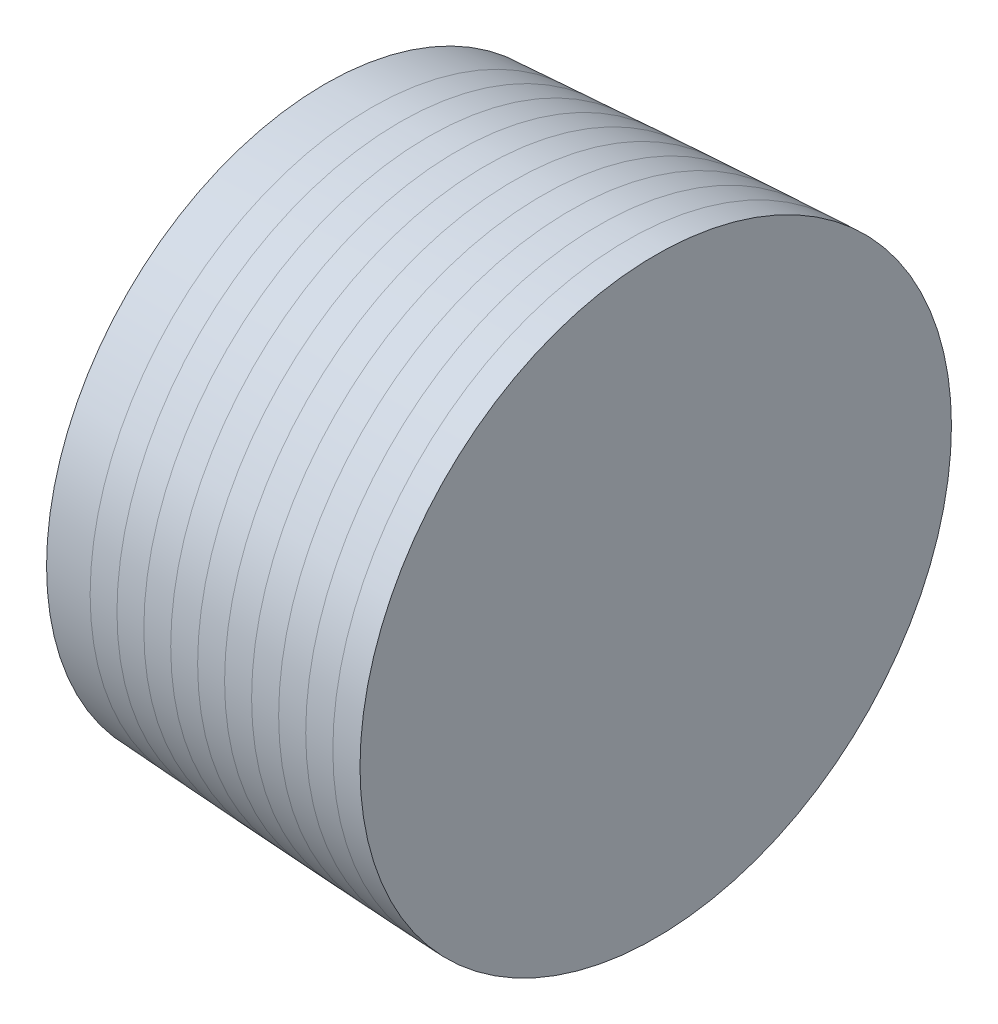
ISO-10303-21;
HEADER;
FILE_DESCRIPTION(('STEP AP214'),'2;1');
FILE_NAME('part.step','',(''),(''),'','','');
FILE_SCHEMA(('AUTOMOTIVE_DESIGN { 1 0 10303 214 1 1 1 1 }'));
ENDSEC;
DATA;
#1=APPLICATION_CONTEXT('core data for automotive mechanical design processes');
#2=APPLICATION_PROTOCOL_DEFINITION('international standard','automotive_design',2000,#1);
#3=PRODUCT_CONTEXT('',#1,'mechanical');
#4=PRODUCT('Part','Part','',(#3));
#5=PRODUCT_RELATED_PRODUCT_CATEGORY('part','',(#4));
#6=PRODUCT_DEFINITION_FORMATION('','',#4);
#7=PRODUCT_DEFINITION_CONTEXT('part definition',#1,'design');
#8=PRODUCT_DEFINITION('design','',#6,#7);
#9=PRODUCT_DEFINITION_SHAPE('','',#8);
#10=(LENGTH_UNIT() NAMED_UNIT(*) SI_UNIT(.MILLI.,.METRE.));
#11=(NAMED_UNIT(*) PLANE_ANGLE_UNIT() SI_UNIT($,.RADIAN.));
#12=(NAMED_UNIT(*) SI_UNIT($,.STERADIAN.) SOLID_ANGLE_UNIT());
#13=UNCERTAINTY_MEASURE_WITH_UNIT(LENGTH_MEASURE(1.E-05),#10,'distance_accuracy_value','');
#14=(GEOMETRIC_REPRESENTATION_CONTEXT(3) GLOBAL_UNCERTAINTY_ASSIGNED_CONTEXT((#13)) GLOBAL_UNIT_ASSIGNED_CONTEXT((#10,
#11,#12)) REPRESENTATION_CONTEXT('',''));
#15=CARTESIAN_POINT('',(0.,0.,0.));
#16=DIRECTION('',(0.,0.,1.));
#17=DIRECTION('',(1.,0.,0.));
#18=AXIS2_PLACEMENT_3D('',#15,#16,#17);
#19=CARTESIAN_POINT('',(504.19,0.,0.));
#20=DIRECTION('',(1.,0.,0.));
#21=DIRECTION('',(0.,0.,-1.));
#22=AXIS2_PLACEMENT_3D('',#19,#20,#21);
#23=PLANE('',#22);
#24=CARTESIAN_POINT('',(504.19,0.,0.));
#25=DIRECTION('',(-1.,0.,0.));
#26=DIRECTION('',(0.,0.,1.));
#27=AXIS2_PLACEMENT_3D('',#24,#25,#26);
#28=CIRCLE('',#27,53.9922702391482);
#29=CARTESIAN_POINT('',(504.19,0.,53.9922702391482));
#30=VERTEX_POINT('',#29);
#31=EDGE_CURVE('E11',#30,#30,#28,.F.);
#32=ORIENTED_EDGE('',*,*,#31,.F.);
#33=EDGE_LOOP('',(#32));
#34=FACE_BOUND('',#33,.T.);
#35=ADVANCED_FACE('F48',(#34),#23,.F.);
#36=CARTESIAN_POINT('',(509.651,0.,0.));
#37=DIRECTION('',(1.,0.,0.));
#38=DIRECTION('',(0.,0.,-1.));
#39=AXIS2_PLACEMENT_3D('',#36,#37,#38);
#40=PLANE('',#39);
#41=CARTESIAN_POINT('',(509.651,0.,0.));
#42=DIRECTION('',(-1.,0.,0.));
#43=DIRECTION('',(0.,0.,1.));
#44=AXIS2_PLACEMENT_3D('',#41,#42,#43);
#45=CIRCLE('',#44,54.303329995861);
#46=CARTESIAN_POINT('',(509.651,0.,54.303329995861));
#47=VERTEX_POINT('',#46);
#48=EDGE_CURVE('E58',#47,#47,#45,.F.);
#49=ORIENTED_EDGE('',*,*,#48,.T.);
#50=EDGE_LOOP('',(#49));
#51=FACE_BOUND('',#50,.T.);
#52=ADVANCED_FACE('F65',(#51),#40,.T.);
#53=CARTESIAN_POINT('',(635.,65.405,0.));
#54=CARTESIAN_POINT('',(632.980968041376,65.3999049079982,0.));
#55=CARTESIAN_POINT('',(628.943051518666,65.3607987649682,0.));
#56=CARTESIAN_POINT('',(620.867800743739,65.238425835158,0.));
#57=CARTESIAN_POINT('',(607.876612197197,64.9420444267635,0.));
#58=CARTESIAN_POINT('',(591.989866173885,64.4665825864284,0.));
#59=CARTESIAN_POINT('',(568.294487812533,63.5924578117391,0.));
#60=CARTESIAN_POINT('',(538.814064527861,62.2664605978091,0.));
#61=CARTESIAN_POINT('',(504.434100625351,60.4361863708921,0.));
#62=CARTESIAN_POINT('',(465.161890456531,58.0127528854532,0.));
#63=CARTESIAN_POINT('',(425.909385737502,55.2895252497301,0.));
#64=CARTESIAN_POINT('',(386.677550901074,52.2836135264071,0.));
#65=CARTESIAN_POINT('',(347.46776242828,49.0025673324941,0.));
#66=CARTESIAN_POINT('',(308.282068325667,45.4454012222465,0.));
#67=CARTESIAN_POINT('',(269.123174714222,41.6037605555624,0.));
#68=CARTESIAN_POINT('',(229.995170684784,37.4592339547084,0.));
#69=CARTESIAN_POINT('',(190.90356887878,32.9826992551564,0.));
#70=CARTESIAN_POINT('',(151.857530337521,28.1241973222402,0.));
#71=CARTESIAN_POINT('',(112.870807325211,22.8061369351955,0.));
#72=CARTESIAN_POINT('',(77.9573287846358,17.4873019784259,0.));
#73=CARTESIAN_POINT('',(49.691922506701,12.6022621047292,0.));
#74=CARTESIAN_POINT('',(31.2124598134355,8.89829644794129,0.));
#75=CARTESIAN_POINT('',(22.4234973059566,6.91999826072989,0.));
#76=CARTESIAN_POINT('',(19.3075240312599,6.17668852516933,0.));
#77=B_SPLINE_CURVE_WITH_KNOTS('',4,(#53,#54,#55,#56,#57,#58,#59,#60,#61,#62,#63,#64,#65,#66,#67,
#68,#69,#70,#71,#72,#73,#74,#75,#76),.UNSPECIFIED.,.F.,.F.,(5,1,1,1,1,1,1,1,1,1,1,1,1,1,1,1,1,1,
1,1,5),(0.,0.0126278600836156,0.0252557201672313,0.0505114403344626,0.0812725997628029,
0.112033759191143,0.173556078208551,0.235078396298971,0.296600715210933,0.358123034494872,
0.419645352372099,0.481167670690979,0.542689989321029,0.604212308113024,0.665734626856386,
0.727256945203041,0.788779262537685,0.850301578000527,0.911823895791277,0.948128969524394,
0.968164565063639),.UNSPECIFIED.);
#78=CARTESIAN_POINT('',(0.,0.,0.));
#79=DIRECTION('',(-1.,0.,0.));
#80=AXIS1_PLACEMENT('',#78,#79);
#81=SURFACE_OF_REVOLUTION('',#77,#80);
#82=OFFSET_SURFACE('',#81,-6.35,.F.);
#83=ORIENTED_EDGE('',*,*,#31,.T.);
#84=EDGE_LOOP('',(#83));
#85=FACE_BOUND('',#84,.T.);
#86=ORIENTED_EDGE('',*,*,#48,.F.);
#87=EDGE_LOOP('',(#86));
#88=FACE_BOUND('',#87,.T.);
#89=ADVANCED_FACE('F67',(#85,#88),#82,.T.);
#90=CLOSED_SHELL('',(#35,#52,#89));
#91=MANIFOLD_SOLID_BREP('B2',#90);
#92=CARTESIAN_POINT('',(515.112,0.,0.));
#93=DIRECTION('',(1.,0.,0.));
#94=DIRECTION('',(0.,0.,-1.));
#95=AXIS2_PLACEMENT_3D('',#92,#93,#94);
#96=PLANE('',#95);
#97=CARTESIAN_POINT('',(515.112,0.,0.));
#98=DIRECTION('',(-1.,0.,0.));
#99=DIRECTION('',(0.,0.,1.));
#100=AXIS2_PLACEMENT_3D('',#97,#98,#99);
#101=CIRCLE('',#100,54.6077792733118);
#102=CARTESIAN_POINT('',(515.112,0.,54.6077792733118));
#103=VERTEX_POINT('',#102);
#104=EDGE_CURVE('E47',#103,#103,#101,.F.);
#105=ORIENTED_EDGE('',*,*,#104,.F.);
#106=EDGE_LOOP('',(#105));
#107=FACE_BOUND('',#106,.T.);
#108=ADVANCED_FACE('F108',(#107),#96,.F.);
#109=CARTESIAN_POINT('',(520.573,0.,0.));
#110=DIRECTION('',(1.,0.,0.));
#111=DIRECTION('',(0.,0.,-1.));
#112=AXIS2_PLACEMENT_3D('',#109,#110,#111);
#113=PLANE('',#112);
#114=CARTESIAN_POINT('',(520.573,0.,0.));
#115=DIRECTION('',(-1.,0.,0.));
#116=DIRECTION('',(0.,0.,1.));
#117=AXIS2_PLACEMENT_3D('',#114,#115,#116);
#118=CIRCLE('',#117,54.9054868575674);
#119=CARTESIAN_POINT('',(520.573,0.,54.9054868575674));
#120=VERTEX_POINT('',#119);
#121=EDGE_CURVE('E118',#120,#120,#118,.F.);
#122=ORIENTED_EDGE('',*,*,#121,.T.);
#123=EDGE_LOOP('',(#122));
#124=FACE_BOUND('',#123,.T.);
#125=ADVANCED_FACE('F125',(#124),#113,.T.);
#126=CARTESIAN_POINT('',(635.,65.405,0.));
#127=CARTESIAN_POINT('',(632.980968041376,65.3999049079982,0.));
#128=CARTESIAN_POINT('',(628.943051518666,65.3607987649682,0.));
#129=CARTESIAN_POINT('',(620.867800743739,65.238425835158,0.));
#130=CARTESIAN_POINT('',(607.876612197197,64.9420444267635,0.));
#131=CARTESIAN_POINT('',(591.989866173885,64.4665825864284,0.));
#132=CARTESIAN_POINT('',(568.294487812533,63.5924578117391,0.));
#133=CARTESIAN_POINT('',(538.814064527861,62.2664605978091,0.));
#134=CARTESIAN_POINT('',(504.434100625351,60.4361863708921,0.));
#135=CARTESIAN_POINT('',(465.161890456531,58.0127528854532,0.));
#136=CARTESIAN_POINT('',(425.909385737502,55.2895252497301,0.));
#137=CARTESIAN_POINT('',(386.677550901074,52.2836135264071,0.));
#138=CARTESIAN_POINT('',(347.46776242828,49.0025673324941,0.));
#139=CARTESIAN_POINT('',(308.282068325667,45.4454012222465,0.));
#140=CARTESIAN_POINT('',(269.123174714222,41.6037605555624,0.));
#141=CARTESIAN_POINT('',(229.995170684784,37.4592339547084,0.));
#142=CARTESIAN_POINT('',(190.90356887878,32.9826992551564,0.));
#143=CARTESIAN_POINT('',(151.857530337521,28.1241973222402,0.));
#144=CARTESIAN_POINT('',(112.870807325211,22.8061369351955,0.));
#145=CARTESIAN_POINT('',(77.9573287846358,17.4873019784259,0.));
#146=CARTESIAN_POINT('',(49.691922506701,12.6022621047292,0.));
#147=CARTESIAN_POINT('',(31.2124598134355,8.89829644794129,0.));
#148=CARTESIAN_POINT('',(22.4234973059566,6.91999826072989,0.));
#149=CARTESIAN_POINT('',(19.3075240312599,6.17668852516933,0.));
#150=B_SPLINE_CURVE_WITH_KNOTS('',4,(#126,#127,#128,#129,#130,#131,#132,#133,#134,#135,#136,
#137,#138,#139,#140,#141,#142,#143,#144,#145,#146,#147,#148,#149),.UNSPECIFIED.,.F.,.F.,(5,1,1,
1,1,1,1,1,1,1,1,1,1,1,1,1,1,1,1,1,5),(0.,0.0126278600836156,0.0252557201672313,
0.0505114403344626,0.0812725997628029,0.112033759191143,0.173556078208551,0.235078396298971,
0.296600715210933,0.358123034494872,0.419645352372099,0.481167670690979,0.542689989321029,
0.604212308113024,0.665734626856386,0.727256945203041,0.788779262537685,0.850301578000527,
0.911823895791277,0.948128969524394,0.968164565063639),.UNSPECIFIED.);
#151=CARTESIAN_POINT('',(0.,0.,0.));
#152=DIRECTION('',(-1.,0.,0.));
#153=AXIS1_PLACEMENT('',#151,#152);
#154=SURFACE_OF_REVOLUTION('',#150,#153);
#155=OFFSET_SURFACE('',#154,-6.35,.F.);
#156=ORIENTED_EDGE('',*,*,#104,.T.);
#157=EDGE_LOOP('',(#156));
#158=FACE_BOUND('',#157,.T.);
#159=ORIENTED_EDGE('',*,*,#121,.F.);
#160=EDGE_LOOP('',(#159));
#161=FACE_BOUND('',#160,.T.);
#162=ADVANCED_FACE('F127',(#158,#161),#155,.T.);
#163=CLOSED_SHELL('',(#108,#125,#162));
#164=MANIFOLD_SOLID_BREP('B6',#163);
#165=CARTESIAN_POINT('',(531.495,0.,0.));
#166=DIRECTION('',(1.,0.,0.));
#167=DIRECTION('',(0.,0.,-1.));
#168=AXIS2_PLACEMENT_3D('',#165,#166,#167);
#169=PLANE('',#168);
#170=CARTESIAN_POINT('',(531.495,0.,0.));
#171=DIRECTION('',(-1.,0.,0.));
#172=DIRECTION('',(0.,0.,1.));
#173=AXIS2_PLACEMENT_3D('',#170,#171,#172);
#174=CIRCLE('',#173,55.4801039444911);
#175=CARTESIAN_POINT('',(531.495,0.,55.4801039444911));
#176=VERTEX_POINT('',#175);
#177=EDGE_CURVE('E107',#176,#176,#174,.F.);
#178=ORIENTED_EDGE('',*,*,#177,.F.);
#179=EDGE_LOOP('',(#178));
#180=FACE_BOUND('',#179,.T.);
#181=ADVANCED_FACE('F168',(#180),#169,.F.);
#182=CARTESIAN_POINT('',(536.956,0.,0.));
#183=DIRECTION('',(1.,0.,0.));
#184=DIRECTION('',(0.,0.,-1.));
#185=AXIS2_PLACEMENT_3D('',#182,#183,#184);
#186=PLANE('',#185);
#187=CARTESIAN_POINT('',(536.956,0.,0.));
#188=DIRECTION('',(-1.,0.,0.));
#189=DIRECTION('',(0.,0.,1.));
#190=AXIS2_PLACEMENT_3D('',#187,#188,#189);
#191=CIRCLE('',#190,55.7566922304204);
#192=CARTESIAN_POINT('',(536.956,0.,55.7566922304204));
#193=VERTEX_POINT('',#192);
#194=EDGE_CURVE('E178',#193,#193,#191,.F.);
#195=ORIENTED_EDGE('',*,*,#194,.T.);
#196=EDGE_LOOP('',(#195));
#197=FACE_BOUND('',#196,.T.);
#198=ADVANCED_FACE('F185',(#197),#186,.T.);
#199=CARTESIAN_POINT('',(635.,65.405,0.));
#200=CARTESIAN_POINT('',(632.980968041376,65.3999049079982,0.));
#201=CARTESIAN_POINT('',(628.943051518666,65.3607987649682,0.));
#202=CARTESIAN_POINT('',(620.867800743739,65.238425835158,0.));
#203=CARTESIAN_POINT('',(607.876612197197,64.9420444267635,0.));
#204=CARTESIAN_POINT('',(591.989866173885,64.4665825864284,0.));
#205=CARTESIAN_POINT('',(568.294487812533,63.5924578117391,0.));
#206=CARTESIAN_POINT('',(538.814064527861,62.2664605978091,0.));
#207=CARTESIAN_POINT('',(504.434100625351,60.4361863708921,0.));
#208=CARTESIAN_POINT('',(465.161890456531,58.0127528854532,0.));
#209=CARTESIAN_POINT('',(425.909385737502,55.2895252497301,0.));
#210=CARTESIAN_POINT('',(386.677550901074,52.2836135264071,0.));
#211=CARTESIAN_POINT('',(347.46776242828,49.0025673324941,0.));
#212=CARTESIAN_POINT('',(308.282068325667,45.4454012222465,0.));
#213=CARTESIAN_POINT('',(269.123174714222,41.6037605555624,0.));
#214=CARTESIAN_POINT('',(229.995170684784,37.4592339547084,0.));
#215=CARTESIAN_POINT('',(190.90356887878,32.9826992551564,0.));
#216=CARTESIAN_POINT('',(151.857530337521,28.1241973222402,0.));
#217=CARTESIAN_POINT('',(112.870807325211,22.8061369351955,0.));
#218=CARTESIAN_POINT('',(77.9573287846358,17.4873019784259,0.));
#219=CARTESIAN_POINT('',(49.691922506701,12.6022621047292,0.));
#220=CARTESIAN_POINT('',(31.2124598134355,8.89829644794129,0.));
#221=CARTESIAN_POINT('',(22.4234973059566,6.91999826072989,0.));
#222=CARTESIAN_POINT('',(19.3075240312599,6.17668852516933,0.));
#223=B_SPLINE_CURVE_WITH_KNOTS('',4,(#199,#200,#201,#202,#203,#204,#205,#206,#207,#208,#209,
#210,#211,#212,#213,#214,#215,#216,#217,#218,#219,#220,#221,#222),.UNSPECIFIED.,.F.,.F.,(5,1,1,
1,1,1,1,1,1,1,1,1,1,1,1,1,1,1,1,1,5),(0.,0.0126278600836156,0.0252557201672313,
0.0505114403344626,0.0812725997628029,0.112033759191143,0.173556078208551,0.235078396298971,
0.296600715210933,0.358123034494872,0.419645352372099,0.481167670690979,0.542689989321029,
0.604212308113024,0.665734626856386,0.727256945203041,0.788779262537685,0.850301578000527,
0.911823895791277,0.948128969524394,0.968164565063639),.UNSPECIFIED.);
#224=CARTESIAN_POINT('',(0.,0.,0.));
#225=DIRECTION('',(-1.,0.,0.));
#226=AXIS1_PLACEMENT('',#224,#225);
#227=SURFACE_OF_REVOLUTION('',#223,#226);
#228=OFFSET_SURFACE('',#227,-6.35,.F.);
#229=ORIENTED_EDGE('',*,*,#177,.T.);
#230=EDGE_LOOP('',(#229));
#231=FACE_BOUND('',#230,.T.);
#232=ORIENTED_EDGE('',*,*,#194,.F.);
#233=EDGE_LOOP('',(#232));
#234=FACE_BOUND('',#233,.T.);
#235=ADVANCED_FACE('F187',(#231,#234),#228,.T.);
#236=CLOSED_SHELL('',(#181,#198,#235));
#237=MANIFOLD_SOLID_BREP('B42',#236);
#238=CARTESIAN_POINT('',(536.956,0.,0.));
#239=DIRECTION('',(1.,0.,0.));
#240=DIRECTION('',(0.,0.,-1.));
#241=AXIS2_PLACEMENT_3D('',#238,#239,#240);
#242=PLANE('',#241);
#243=CARTESIAN_POINT('',(536.956,0.,0.));
#244=DIRECTION('',(-1.,0.,0.));
#245=DIRECTION('',(0.,0.,1.));
#246=AXIS2_PLACEMENT_3D('',#243,#244,#245);
#247=CIRCLE('',#246,55.7566922304204);
#248=CARTESIAN_POINT('',(536.956,0.,55.7566922304204));
#249=VERTEX_POINT('',#248);
#250=EDGE_CURVE('E167',#249,#249,#247,.F.);
#251=ORIENTED_EDGE('',*,*,#250,.F.);
#252=EDGE_LOOP('',(#251));
#253=FACE_BOUND('',#252,.T.);
#254=ADVANCED_FACE('F228',(#253),#242,.F.);
#255=CARTESIAN_POINT('',(542.417,0.,0.));
#256=DIRECTION('',(1.,0.,0.));
#257=DIRECTION('',(0.,0.,-1.));
#258=AXIS2_PLACEMENT_3D('',#255,#256,#257);
#259=PLANE('',#258);
#260=CARTESIAN_POINT('',(542.417,0.,0.));
#261=DIRECTION('',(-1.,0.,0.));
#262=DIRECTION('',(0.,0.,1.));
#263=AXIS2_PLACEMENT_3D('',#260,#261,#262);
#264=CIRCLE('',#263,56.025884843362);
#265=CARTESIAN_POINT('',(542.417,0.,56.025884843362));
#266=VERTEX_POINT('',#265);
#267=EDGE_CURVE('E238',#266,#266,#264,.F.);
#268=ORIENTED_EDGE('',*,*,#267,.T.);
#269=EDGE_LOOP('',(#268));
#270=FACE_BOUND('',#269,.T.);
#271=ADVANCED_FACE('F245',(#270),#259,.T.);
#272=CARTESIAN_POINT('',(635.,65.405,0.));
#273=CARTESIAN_POINT('',(632.980968041376,65.3999049079982,0.));
#274=CARTESIAN_POINT('',(628.943051518666,65.3607987649682,0.));
#275=CARTESIAN_POINT('',(620.867800743739,65.238425835158,0.));
#276=CARTESIAN_POINT('',(607.876612197197,64.9420444267635,0.));
#277=CARTESIAN_POINT('',(591.989866173885,64.4665825864284,0.));
#278=CARTESIAN_POINT('',(568.294487812533,63.5924578117391,0.));
#279=CARTESIAN_POINT('',(538.814064527861,62.2664605978091,0.));
#280=CARTESIAN_POINT('',(504.434100625351,60.4361863708921,0.));
#281=CARTESIAN_POINT('',(465.161890456531,58.0127528854532,0.));
#282=CARTESIAN_POINT('',(425.909385737502,55.2895252497301,0.));
#283=CARTESIAN_POINT('',(386.677550901074,52.2836135264071,0.));
#284=CARTESIAN_POINT('',(347.46776242828,49.0025673324941,0.));
#285=CARTESIAN_POINT('',(308.282068325667,45.4454012222465,0.));
#286=CARTESIAN_POINT('',(269.123174714222,41.6037605555624,0.));
#287=CARTESIAN_POINT('',(229.995170684784,37.4592339547084,0.));
#288=CARTESIAN_POINT('',(190.90356887878,32.9826992551564,0.));
#289=CARTESIAN_POINT('',(151.857530337521,28.1241973222402,0.));
#290=CARTESIAN_POINT('',(112.870807325211,22.8061369351955,0.));
#291=CARTESIAN_POINT('',(77.9573287846358,17.4873019784259,0.));
#292=CARTESIAN_POINT('',(49.691922506701,12.6022621047292,0.));
#293=CARTESIAN_POINT('',(31.2124598134355,8.89829644794129,0.));
#294=CARTESIAN_POINT('',(22.4234973059566,6.91999826072989,0.));
#295=CARTESIAN_POINT('',(19.3075240312599,6.17668852516933,0.));
#296=B_SPLINE_CURVE_WITH_KNOTS('',4,(#272,#273,#274,#275,#276,#277,#278,#279,#280,#281,#282,
#283,#284,#285,#286,#287,#288,#289,#290,#291,#292,#293,#294,#295),.UNSPECIFIED.,.F.,.F.,(5,1,1,
1,1,1,1,1,1,1,1,1,1,1,1,1,1,1,1,1,5),(0.,0.0126278600836156,0.0252557201672313,
0.0505114403344626,0.0812725997628029,0.112033759191143,0.173556078208551,0.235078396298971,
0.296600715210933,0.358123034494872,0.419645352372099,0.481167670690979,0.542689989321029,
0.604212308113024,0.665734626856386,0.727256945203041,0.788779262537685,0.850301578000527,
0.911823895791277,0.948128969524394,0.968164565063639),.UNSPECIFIED.);
#297=CARTESIAN_POINT('',(0.,0.,0.));
#298=DIRECTION('',(-1.,0.,0.));
#299=AXIS1_PLACEMENT('',#297,#298);
#300=SURFACE_OF_REVOLUTION('',#296,#299);
#301=OFFSET_SURFACE('',#300,-6.35,.F.);
#302=ORIENTED_EDGE('',*,*,#250,.T.);
#303=EDGE_LOOP('',(#302));
#304=FACE_BOUND('',#303,.T.);
#305=ORIENTED_EDGE('',*,*,#267,.F.);
#306=EDGE_LOOP('',(#305));
#307=FACE_BOUND('',#306,.T.);
#308=ADVANCED_FACE('F247',(#304,#307),#301,.T.);
#309=CLOSED_SHELL('',(#254,#271,#308));
#310=MANIFOLD_SOLID_BREP('B102',#309);
#311=CARTESIAN_POINT('',(547.878,0.,0.));
#312=DIRECTION('',(1.,0.,0.));
#313=DIRECTION('',(0.,0.,-1.));
#314=AXIS2_PLACEMENT_3D('',#311,#312,#313);
#315=PLANE('',#314);
#316=CARTESIAN_POINT('',(547.878,0.,0.));
#317=DIRECTION('',(-1.,0.,0.));
#318=DIRECTION('',(0.,0.,1.));
#319=AXIS2_PLACEMENT_3D('',#316,#317,#318);
#320=CIRCLE('',#319,56.287467029387);
#321=CARTESIAN_POINT('',(547.878,0.,56.287467029387));
#322=VERTEX_POINT('',#321);
#323=EDGE_CURVE('E292',#322,#322,#320,.F.);
#324=ORIENTED_EDGE('',*,*,#323,.F.);
#325=EDGE_LOOP('',(#324));
#326=FACE_BOUND('',#325,.T.);
#327=ADVANCED_FACE('F288',(#326),#315,.F.);
#328=CARTESIAN_POINT('',(553.339,0.,0.));
#329=DIRECTION('',(1.,0.,0.));
#330=DIRECTION('',(0.,0.,-1.));
#331=AXIS2_PLACEMENT_3D('',#328,#329,#330);
#332=PLANE('',#331);
#333=CARTESIAN_POINT('',(553.339,0.,0.));
#334=DIRECTION('',(-1.,0.,0.));
#335=DIRECTION('',(0.,0.,1.));
#336=AXIS2_PLACEMENT_3D('',#333,#334,#335);
#337=CIRCLE('',#336,56.5412015126397);
#338=CARTESIAN_POINT('',(553.339,0.,56.5412015126397));
#339=VERTEX_POINT('',#338);
#340=EDGE_CURVE('E227',#339,#339,#337,.F.);
#341=ORIENTED_EDGE('',*,*,#340,.T.);
#342=EDGE_LOOP('',(#341));
#343=FACE_BOUND('',#342,.T.);
#344=ADVANCED_FACE('F290',(#343),#332,.T.);
#345=CARTESIAN_POINT('',(635.,65.405,0.));
#346=CARTESIAN_POINT('',(632.980968041376,65.3999049079982,0.));
#347=CARTESIAN_POINT('',(628.943051518666,65.3607987649682,0.));
#348=CARTESIAN_POINT('',(620.867800743739,65.238425835158,0.));
#349=CARTESIAN_POINT('',(607.876612197197,64.9420444267635,0.));
#350=CARTESIAN_POINT('',(591.989866173885,64.4665825864284,0.));
#351=CARTESIAN_POINT('',(568.294487812533,63.5924578117391,0.));
#352=CARTESIAN_POINT('',(538.814064527861,62.2664605978091,0.));
#353=CARTESIAN_POINT('',(504.434100625351,60.4361863708921,0.));
#354=CARTESIAN_POINT('',(465.161890456531,58.0127528854532,0.));
#355=CARTESIAN_POINT('',(425.909385737502,55.2895252497301,0.));
#356=CARTESIAN_POINT('',(386.677550901074,52.2836135264071,0.));
#357=CARTESIAN_POINT('',(347.46776242828,49.0025673324941,0.));
#358=CARTESIAN_POINT('',(308.282068325667,45.4454012222465,0.));
#359=CARTESIAN_POINT('',(269.123174714222,41.6037605555624,0.));
#360=CARTESIAN_POINT('',(229.995170684784,37.4592339547084,0.));
#361=CARTESIAN_POINT('',(190.90356887878,32.9826992551564,0.));
#362=CARTESIAN_POINT('',(151.857530337521,28.1241973222402,0.));
#363=CARTESIAN_POINT('',(112.870807325211,22.8061369351955,0.));
#364=CARTESIAN_POINT('',(77.9573287846358,17.4873019784259,0.));
#365=CARTESIAN_POINT('',(49.691922506701,12.6022621047292,0.));
#366=CARTESIAN_POINT('',(31.2124598134355,8.89829644794129,0.));
#367=CARTESIAN_POINT('',(22.4234973059566,6.91999826072989,0.));
#368=CARTESIAN_POINT('',(19.3075240312599,6.17668852516933,0.));
#369=B_SPLINE_CURVE_WITH_KNOTS('',4,(#345,#346,#347,#348,#349,#350,#351,#352,#353,#354,#355,
#356,#357,#358,#359,#360,#361,#362,#363,#364,#365,#366,#367,#368),.UNSPECIFIED.,.F.,.F.,(5,1,1,
1,1,1,1,1,1,1,1,1,1,1,1,1,1,1,1,1,5),(0.,0.0126278600836156,0.0252557201672313,
0.0505114403344626,0.0812725997628029,0.112033759191143,0.173556078208551,0.235078396298971,
0.296600715210933,0.358123034494872,0.419645352372099,0.481167670690979,0.542689989321029,
0.604212308113024,0.665734626856386,0.727256945203041,0.788779262537685,0.850301578000527,
0.911823895791277,0.948128969524394,0.968164565063639),.UNSPECIFIED.);
#370=CARTESIAN_POINT('',(0.,0.,0.));
#371=DIRECTION('',(-1.,0.,0.));
#372=AXIS1_PLACEMENT('',#370,#371);
#373=SURFACE_OF_REVOLUTION('',#369,#372);
#374=OFFSET_SURFACE('',#373,-6.35,.F.);
#375=ORIENTED_EDGE('',*,*,#323,.T.);
#376=EDGE_LOOP('',(#375));
#377=FACE_BOUND('',#376,.T.);
#378=ORIENTED_EDGE('',*,*,#340,.F.);
#379=EDGE_LOOP('',(#378));
#380=FACE_BOUND('',#379,.T.);
#381=ADVANCED_FACE('F309',(#377,#380),#374,.T.);
#382=CLOSED_SHELL('',(#327,#344,#381));
#383=MANIFOLD_SOLID_BREP('B162',#382);
#384=CARTESIAN_POINT('',(553.339,0.,0.));
#385=DIRECTION('',(1.,0.,0.));
#386=DIRECTION('',(0.,0.,-1.));
#387=AXIS2_PLACEMENT_3D('',#384,#385,#386);
#388=PLANE('',#387);
#389=CARTESIAN_POINT('',(553.339,0.,0.));
#390=DIRECTION('',(-1.,0.,0.));
#391=DIRECTION('',(0.,0.,1.));
#392=AXIS2_PLACEMENT_3D('',#389,#390,#391);
#393=CIRCLE('',#392,56.5412015126397);
#394=CARTESIAN_POINT('',(553.339,0.,56.5412015126397));
#395=VERTEX_POINT('',#394);
#396=EDGE_CURVE('E358',#395,#395,#393,.F.);
#397=ORIENTED_EDGE('',*,*,#396,.F.);
#398=EDGE_LOOP('',(#397));
#399=FACE_BOUND('',#398,.T.);
#400=ADVANCED_FACE('F348',(#399),#388,.F.);
#401=CARTESIAN_POINT('',(558.8,0.,0.));
#402=DIRECTION('',(1.,0.,0.));
#403=DIRECTION('',(0.,0.,-1.));
#404=AXIS2_PLACEMENT_3D('',#401,#402,#403);
#405=PLANE('',#404);
#406=CARTESIAN_POINT('',(558.8,0.,0.));
#407=DIRECTION('',(-1.,0.,0.));
#408=DIRECTION('',(0.,0.,1.));
#409=AXIS2_PLACEMENT_3D('',#406,#407,#408);
#410=CIRCLE('',#409,56.7868285004782);
#411=CARTESIAN_POINT('',(558.8,0.,56.7868285004782));
#412=VERTEX_POINT('',#411);
#413=EDGE_CURVE('E287',#412,#412,#410,.T.);
#414=ORIENTED_EDGE('',*,*,#413,.F.);
#415=EDGE_LOOP('',(#414));
#416=FACE_BOUND('',#415,.T.);
#417=ADVANCED_FACE('F368',(#416),#405,.T.);
#418=CARTESIAN_POINT('',(635.,65.405,0.));
#419=CARTESIAN_POINT('',(632.980968041376,65.3999049079982,0.));
#420=CARTESIAN_POINT('',(628.943051518666,65.3607987649682,0.));
#421=CARTESIAN_POINT('',(620.867800743739,65.238425835158,0.));
#422=CARTESIAN_POINT('',(607.876612197197,64.9420444267635,0.));
#423=CARTESIAN_POINT('',(591.989866173885,64.4665825864284,0.));
#424=CARTESIAN_POINT('',(568.294487812533,63.5924578117391,0.));
#425=CARTESIAN_POINT('',(538.814064527861,62.2664605978091,0.));
#426=CARTESIAN_POINT('',(504.434100625351,60.4361863708921,0.));
#427=CARTESIAN_POINT('',(465.161890456531,58.0127528854532,0.));
#428=CARTESIAN_POINT('',(425.909385737502,55.2895252497301,0.));
#429=CARTESIAN_POINT('',(386.677550901074,52.2836135264071,0.));
#430=CARTESIAN_POINT('',(347.46776242828,49.0025673324941,0.));
#431=CARTESIAN_POINT('',(308.282068325667,45.4454012222465,0.));
#432=CARTESIAN_POINT('',(269.123174714222,41.6037605555624,0.));
#433=CARTESIAN_POINT('',(229.995170684784,37.4592339547084,0.));
#434=CARTESIAN_POINT('',(190.90356887878,32.9826992551564,0.));
#435=CARTESIAN_POINT('',(151.857530337521,28.1241973222402,0.));
#436=CARTESIAN_POINT('',(112.870807325211,22.8061369351955,0.));
#437=CARTESIAN_POINT('',(77.9573287846358,17.4873019784259,0.));
#438=CARTESIAN_POINT('',(49.691922506701,12.6022621047292,0.));
#439=CARTESIAN_POINT('',(31.2124598134355,8.89829644794129,0.));
#440=CARTESIAN_POINT('',(22.4234973059566,6.91999826072989,0.));
#441=CARTESIAN_POINT('',(19.3075240312599,6.17668852516933,0.));
#442=B_SPLINE_CURVE_WITH_KNOTS('',4,(#418,#419,#420,#421,#422,#423,#424,#425,#426,#427,#428,
#429,#430,#431,#432,#433,#434,#435,#436,#437,#438,#439,#440,#441),.UNSPECIFIED.,.F.,.F.,(5,1,1,
1,1,1,1,1,1,1,1,1,1,1,1,1,1,1,1,1,5),(0.,0.0126278600836156,0.0252557201672313,
0.0505114403344626,0.0812725997628029,0.112033759191143,0.173556078208551,0.235078396298971,
0.296600715210933,0.358123034494872,0.419645352372099,0.481167670690979,0.542689989321029,
0.604212308113024,0.665734626856386,0.727256945203041,0.788779262537685,0.850301578000527,
0.911823895791277,0.948128969524394,0.968164565063639),.UNSPECIFIED.);
#443=CARTESIAN_POINT('',(0.,0.,0.));
#444=DIRECTION('',(-1.,0.,0.));
#445=AXIS1_PLACEMENT('',#443,#444);
#446=SURFACE_OF_REVOLUTION('',#442,#445);
#447=OFFSET_SURFACE('',#446,-6.35,.F.);
#448=ORIENTED_EDGE('',*,*,#396,.T.);
#449=EDGE_LOOP('',(#448));
#450=FACE_BOUND('',#449,.T.);
#451=ORIENTED_EDGE('',*,*,#413,.T.);
#452=EDGE_LOOP('',(#451));
#453=FACE_BOUND('',#452,.T.);
#454=ADVANCED_FACE('F365',(#450,#453),#447,.T.);
#455=CLOSED_SHELL('',(#400,#417,#454));
#456=MANIFOLD_SOLID_BREP('B222',#455);
#457=CARTESIAN_POINT('',(509.651,0.,0.));
#458=DIRECTION('',(1.,0.,0.));
#459=DIRECTION('',(0.,0.,-1.));
#460=AXIS2_PLACEMENT_3D('',#457,#458,#459);
#461=PLANE('',#460);
#462=CARTESIAN_POINT('',(509.651,0.,0.));
#463=DIRECTION('',(-1.,0.,0.));
#464=DIRECTION('',(0.,0.,1.));
#465=AXIS2_PLACEMENT_3D('',#462,#463,#464);
#466=CIRCLE('',#465,54.303329995861);
#467=CARTESIAN_POINT('',(509.651,0.,54.303329995861));
#468=VERTEX_POINT('',#467);
#469=EDGE_CURVE('E347',#468,#468,#466,.F.);
#470=ORIENTED_EDGE('',*,*,#469,.F.);
#471=EDGE_LOOP('',(#470));
#472=FACE_BOUND('',#471,.T.);
#473=ADVANCED_FACE('F410',(#472),#461,.F.);
#474=CARTESIAN_POINT('',(515.112,0.,0.));
#475=DIRECTION('',(1.,0.,0.));
#476=DIRECTION('',(0.,0.,-1.));
#477=AXIS2_PLACEMENT_3D('',#474,#475,#476);
#478=PLANE('',#477);
#479=CARTESIAN_POINT('',(515.112,0.,0.));
#480=DIRECTION('',(-1.,0.,0.));
#481=DIRECTION('',(0.,0.,1.));
#482=AXIS2_PLACEMENT_3D('',#479,#480,#481);
#483=CIRCLE('',#482,54.6077792733118);
#484=CARTESIAN_POINT('',(515.112,0.,54.6077792733118));
#485=VERTEX_POINT('',#484);
#486=EDGE_CURVE('E420',#485,#485,#483,.F.);
#487=ORIENTED_EDGE('',*,*,#486,.T.);
#488=EDGE_LOOP('',(#487));
#489=FACE_BOUND('',#488,.T.);
#490=ADVANCED_FACE('F427',(#489),#478,.T.);
#491=CARTESIAN_POINT('',(635.,65.405,0.));
#492=CARTESIAN_POINT('',(632.980968041376,65.3999049079982,0.));
#493=CARTESIAN_POINT('',(628.943051518666,65.3607987649682,0.));
#494=CARTESIAN_POINT('',(620.867800743739,65.238425835158,0.));
#495=CARTESIAN_POINT('',(607.876612197197,64.9420444267635,0.));
#496=CARTESIAN_POINT('',(591.989866173885,64.4665825864284,0.));
#497=CARTESIAN_POINT('',(568.294487812533,63.5924578117391,0.));
#498=CARTESIAN_POINT('',(538.814064527861,62.2664605978091,0.));
#499=CARTESIAN_POINT('',(504.434100625351,60.4361863708921,0.));
#500=CARTESIAN_POINT('',(465.161890456531,58.0127528854532,0.));
#501=CARTESIAN_POINT('',(425.909385737502,55.2895252497301,0.));
#502=CARTESIAN_POINT('',(386.677550901074,52.2836135264071,0.));
#503=CARTESIAN_POINT('',(347.46776242828,49.0025673324941,0.));
#504=CARTESIAN_POINT('',(308.282068325667,45.4454012222465,0.));
#505=CARTESIAN_POINT('',(269.123174714222,41.6037605555624,0.));
#506=CARTESIAN_POINT('',(229.995170684784,37.4592339547084,0.));
#507=CARTESIAN_POINT('',(190.90356887878,32.9826992551564,0.));
#508=CARTESIAN_POINT('',(151.857530337521,28.1241973222402,0.));
#509=CARTESIAN_POINT('',(112.870807325211,22.8061369351955,0.));
#510=CARTESIAN_POINT('',(77.9573287846358,17.4873019784259,0.));
#511=CARTESIAN_POINT('',(49.691922506701,12.6022621047292,0.));
#512=CARTESIAN_POINT('',(31.2124598134355,8.89829644794129,0.));
#513=CARTESIAN_POINT('',(22.4234973059566,6.91999826072989,0.));
#514=CARTESIAN_POINT('',(19.3075240312599,6.17668852516933,0.));
#515=B_SPLINE_CURVE_WITH_KNOTS('',4,(#491,#492,#493,#494,#495,#496,#497,#498,#499,#500,#501,
#502,#503,#504,#505,#506,#507,#508,#509,#510,#511,#512,#513,#514),.UNSPECIFIED.,.F.,.F.,(5,1,1,
1,1,1,1,1,1,1,1,1,1,1,1,1,1,1,1,1,5),(0.,0.0126278600836156,0.0252557201672313,
0.0505114403344626,0.0812725997628029,0.112033759191143,0.173556078208551,0.235078396298971,
0.296600715210933,0.358123034494872,0.419645352372099,0.481167670690979,0.542689989321029,
0.604212308113024,0.665734626856386,0.727256945203041,0.788779262537685,0.850301578000527,
0.911823895791277,0.948128969524394,0.968164565063639),.UNSPECIFIED.);
#516=CARTESIAN_POINT('',(0.,0.,0.));
#517=DIRECTION('',(-1.,0.,0.));
#518=AXIS1_PLACEMENT('',#516,#517);
#519=SURFACE_OF_REVOLUTION('',#515,#518);
#520=OFFSET_SURFACE('',#519,-6.35,.F.);
#521=ORIENTED_EDGE('',*,*,#469,.T.);
#522=EDGE_LOOP('',(#521));
#523=FACE_BOUND('',#522,.T.);
#524=ORIENTED_EDGE('',*,*,#486,.F.);
#525=EDGE_LOOP('',(#524));
#526=FACE_BOUND('',#525,.T.);
#527=ADVANCED_FACE('F429',(#523,#526),#520,.T.);
#528=CLOSED_SHELL('',(#473,#490,#527));
#529=MANIFOLD_SOLID_BREP('B282',#528);
#530=CARTESIAN_POINT('',(520.573,0.,0.));
#531=DIRECTION('',(1.,0.,0.));
#532=DIRECTION('',(0.,0.,-1.));
#533=AXIS2_PLACEMENT_3D('',#530,#531,#532);
#534=PLANE('',#533);
#535=CARTESIAN_POINT('',(520.573,0.,0.));
#536=DIRECTION('',(-1.,0.,0.));
#537=DIRECTION('',(0.,0.,1.));
#538=AXIS2_PLACEMENT_3D('',#535,#536,#537);
#539=CIRCLE('',#538,54.9054868575674);
#540=CARTESIAN_POINT('',(520.573,0.,54.9054868575674));
#541=VERTEX_POINT('',#540);
#542=EDGE_CURVE('E409',#541,#541,#539,.F.);
#543=ORIENTED_EDGE('',*,*,#542,.F.);
#544=EDGE_LOOP('',(#543));
#545=FACE_BOUND('',#544,.T.);
#546=ADVANCED_FACE('F470',(#545),#534,.F.);
#547=CARTESIAN_POINT('',(526.034,0.,0.));
#548=DIRECTION('',(1.,0.,0.));
#549=DIRECTION('',(0.,0.,-1.));
#550=AXIS2_PLACEMENT_3D('',#547,#548,#549);
#551=PLANE('',#550);
#552=CARTESIAN_POINT('',(526.034,0.,0.));
#553=DIRECTION('',(-1.,0.,0.));
#554=DIRECTION('',(0.,0.,1.));
#555=AXIS2_PLACEMENT_3D('',#552,#553,#554);
#556=CIRCLE('',#555,55.1963122114712);
#557=CARTESIAN_POINT('',(526.034,0.,55.1963122114712));
#558=VERTEX_POINT('',#557);
#559=EDGE_CURVE('E480',#558,#558,#556,.F.);
#560=ORIENTED_EDGE('',*,*,#559,.T.);
#561=EDGE_LOOP('',(#560));
#562=FACE_BOUND('',#561,.T.);
#563=ADVANCED_FACE('F487',(#562),#551,.T.);
#564=CARTESIAN_POINT('',(635.,65.405,0.));
#565=CARTESIAN_POINT('',(632.980968041376,65.3999049079982,0.));
#566=CARTESIAN_POINT('',(628.943051518666,65.3607987649682,0.));
#567=CARTESIAN_POINT('',(620.867800743739,65.238425835158,0.));
#568=CARTESIAN_POINT('',(607.876612197197,64.9420444267635,0.));
#569=CARTESIAN_POINT('',(591.989866173885,64.4665825864284,0.));
#570=CARTESIAN_POINT('',(568.294487812533,63.5924578117391,0.));
#571=CARTESIAN_POINT('',(538.814064527861,62.2664605978091,0.));
#572=CARTESIAN_POINT('',(504.434100625351,60.4361863708921,0.));
#573=CARTESIAN_POINT('',(465.161890456531,58.0127528854532,0.));
#574=CARTESIAN_POINT('',(425.909385737502,55.2895252497301,0.));
#575=CARTESIAN_POINT('',(386.677550901074,52.2836135264071,0.));
#576=CARTESIAN_POINT('',(347.46776242828,49.0025673324941,0.));
#577=CARTESIAN_POINT('',(308.282068325667,45.4454012222465,0.));
#578=CARTESIAN_POINT('',(269.123174714222,41.6037605555624,0.));
#579=CARTESIAN_POINT('',(229.995170684784,37.4592339547084,0.));
#580=CARTESIAN_POINT('',(190.90356887878,32.9826992551564,0.));
#581=CARTESIAN_POINT('',(151.857530337521,28.1241973222402,0.));
#582=CARTESIAN_POINT('',(112.870807325211,22.8061369351955,0.));
#583=CARTESIAN_POINT('',(77.9573287846358,17.4873019784259,0.));
#584=CARTESIAN_POINT('',(49.691922506701,12.6022621047292,0.));
#585=CARTESIAN_POINT('',(31.2124598134355,8.89829644794129,0.));
#586=CARTESIAN_POINT('',(22.4234973059566,6.91999826072989,0.));
#587=CARTESIAN_POINT('',(19.3075240312599,6.17668852516933,0.));
#588=B_SPLINE_CURVE_WITH_KNOTS('',4,(#564,#565,#566,#567,#568,#569,#570,#571,#572,#573,#574,
#575,#576,#577,#578,#579,#580,#581,#582,#583,#584,#585,#586,#587),.UNSPECIFIED.,.F.,.F.,(5,1,1,
1,1,1,1,1,1,1,1,1,1,1,1,1,1,1,1,1,5),(0.,0.0126278600836156,0.0252557201672313,
0.0505114403344626,0.0812725997628029,0.112033759191143,0.173556078208551,0.235078396298971,
0.296600715210933,0.358123034494872,0.419645352372099,0.481167670690979,0.542689989321029,
0.604212308113024,0.665734626856386,0.727256945203041,0.788779262537685,0.850301578000527,
0.911823895791277,0.948128969524394,0.968164565063639),.UNSPECIFIED.);
#589=CARTESIAN_POINT('',(0.,0.,0.));
#590=DIRECTION('',(-1.,0.,0.));
#591=AXIS1_PLACEMENT('',#589,#590);
#592=SURFACE_OF_REVOLUTION('',#588,#591);
#593=OFFSET_SURFACE('',#592,-6.35,.F.);
#594=ORIENTED_EDGE('',*,*,#542,.T.);
#595=EDGE_LOOP('',(#594));
#596=FACE_BOUND('',#595,.T.);
#597=ORIENTED_EDGE('',*,*,#559,.F.);
#598=EDGE_LOOP('',(#597));
#599=FACE_BOUND('',#598,.T.);
#600=ADVANCED_FACE('F489',(#596,#599),#593,.T.);
#601=CLOSED_SHELL('',(#546,#563,#600));
#602=MANIFOLD_SOLID_BREP('B342',#601);
#603=CARTESIAN_POINT('',(526.034,0.,0.));
#604=DIRECTION('',(1.,0.,0.));
#605=DIRECTION('',(0.,0.,-1.));
#606=AXIS2_PLACEMENT_3D('',#603,#604,#605);
#607=PLANE('',#606);
#608=CARTESIAN_POINT('',(526.034,0.,0.));
#609=DIRECTION('',(-1.,0.,0.));
#610=DIRECTION('',(0.,0.,1.));
#611=AXIS2_PLACEMENT_3D('',#608,#609,#610);
#612=CIRCLE('',#611,55.1963122114712);
#613=CARTESIAN_POINT('',(526.034,0.,55.1963122114712));
#614=VERTEX_POINT('',#613);
#615=EDGE_CURVE('E469',#614,#614,#612,.F.);
#616=ORIENTED_EDGE('',*,*,#615,.F.);
#617=EDGE_LOOP('',(#616));
#618=FACE_BOUND('',#617,.T.);
#619=ADVANCED_FACE('F530',(#618),#607,.F.);
#620=CARTESIAN_POINT('',(531.495,0.,0.));
#621=DIRECTION('',(1.,0.,0.));
#622=DIRECTION('',(0.,0.,-1.));
#623=AXIS2_PLACEMENT_3D('',#620,#621,#622);
#624=PLANE('',#623);
#625=CARTESIAN_POINT('',(531.495,0.,0.));
#626=DIRECTION('',(-1.,0.,0.));
#627=DIRECTION('',(0.,0.,1.));
#628=AXIS2_PLACEMENT_3D('',#625,#626,#627);
#629=CIRCLE('',#628,55.4801039444911);
#630=CARTESIAN_POINT('',(531.495,0.,55.4801039444911));
#631=VERTEX_POINT('',#630);
#632=EDGE_CURVE('E535',#631,#631,#629,.F.);
#633=ORIENTED_EDGE('',*,*,#632,.T.);
#634=EDGE_LOOP('',(#633));
#635=FACE_BOUND('',#634,.T.);
#636=ADVANCED_FACE('F550',(#635),#624,.T.);
#637=CARTESIAN_POINT('',(635.,65.405,0.));
#638=CARTESIAN_POINT('',(632.980968041376,65.3999049079982,0.));
#639=CARTESIAN_POINT('',(628.943051518666,65.3607987649682,0.));
#640=CARTESIAN_POINT('',(620.867800743739,65.238425835158,0.));
#641=CARTESIAN_POINT('',(607.876612197197,64.9420444267635,0.));
#642=CARTESIAN_POINT('',(591.989866173885,64.4665825864284,0.));
#643=CARTESIAN_POINT('',(568.294487812533,63.5924578117391,0.));
#644=CARTESIAN_POINT('',(538.814064527861,62.2664605978091,0.));
#645=CARTESIAN_POINT('',(504.434100625351,60.4361863708921,0.));
#646=CARTESIAN_POINT('',(465.161890456531,58.0127528854532,0.));
#647=CARTESIAN_POINT('',(425.909385737502,55.2895252497301,0.));
#648=CARTESIAN_POINT('',(386.677550901074,52.2836135264071,0.));
#649=CARTESIAN_POINT('',(347.46776242828,49.0025673324941,0.));
#650=CARTESIAN_POINT('',(308.282068325667,45.4454012222465,0.));
#651=CARTESIAN_POINT('',(269.123174714222,41.6037605555624,0.));
#652=CARTESIAN_POINT('',(229.995170684784,37.4592339547084,0.));
#653=CARTESIAN_POINT('',(190.90356887878,32.9826992551564,0.));
#654=CARTESIAN_POINT('',(151.857530337521,28.1241973222402,0.));
#655=CARTESIAN_POINT('',(112.870807325211,22.8061369351955,0.));
#656=CARTESIAN_POINT('',(77.9573287846358,17.4873019784259,0.));
#657=CARTESIAN_POINT('',(49.691922506701,12.6022621047292,0.));
#658=CARTESIAN_POINT('',(31.2124598134355,8.89829644794129,0.));
#659=CARTESIAN_POINT('',(22.4234973059566,6.91999826072989,0.));
#660=CARTESIAN_POINT('',(19.3075240312599,6.17668852516933,0.));
#661=B_SPLINE_CURVE_WITH_KNOTS('',4,(#637,#638,#639,#640,#641,#642,#643,#644,#645,#646,#647,
#648,#649,#650,#651,#652,#653,#654,#655,#656,#657,#658,#659,#660),.UNSPECIFIED.,.F.,.F.,(5,1,1,
1,1,1,1,1,1,1,1,1,1,1,1,1,1,1,1,1,5),(0.,0.0126278600836156,0.0252557201672313,
0.0505114403344626,0.0812725997628029,0.112033759191143,0.173556078208551,0.235078396298971,
0.296600715210933,0.358123034494872,0.419645352372099,0.481167670690979,0.542689989321029,
0.604212308113024,0.665734626856386,0.727256945203041,0.788779262537685,0.850301578000527,
0.911823895791277,0.948128969524394,0.968164565063639),.UNSPECIFIED.);
#662=CARTESIAN_POINT('',(0.,0.,0.));
#663=DIRECTION('',(-1.,0.,0.));
#664=AXIS1_PLACEMENT('',#662,#663);
#665=SURFACE_OF_REVOLUTION('',#661,#664);
#666=OFFSET_SURFACE('',#665,-6.35,.F.);
#667=ORIENTED_EDGE('',*,*,#615,.T.);
#668=EDGE_LOOP('',(#667));
#669=FACE_BOUND('',#668,.T.);
#670=ORIENTED_EDGE('',*,*,#632,.F.);
#671=EDGE_LOOP('',(#670));
#672=FACE_BOUND('',#671,.T.);
#673=ADVANCED_FACE('F552',(#669,#672),#666,.T.);
#674=CLOSED_SHELL('',(#619,#636,#673));
#675=MANIFOLD_SOLID_BREP('B404',#674);
#676=CARTESIAN_POINT('',(542.417,0.,0.));
#677=DIRECTION('',(1.,0.,0.));
#678=DIRECTION('',(0.,0.,-1.));
#679=AXIS2_PLACEMENT_3D('',#676,#677,#678);
#680=PLANE('',#679);
#681=CARTESIAN_POINT('',(542.417,0.,0.));
#682=DIRECTION('',(-1.,0.,0.));
#683=DIRECTION('',(0.,0.,1.));
#684=AXIS2_PLACEMENT_3D('',#681,#682,#683);
#685=CIRCLE('',#684,56.025884843362);
#686=CARTESIAN_POINT('',(542.417,0.,56.025884843362));
#687=VERTEX_POINT('',#686);
#688=EDGE_CURVE('E529',#687,#687,#685,.F.);
#689=ORIENTED_EDGE('',*,*,#688,.F.);
#690=EDGE_LOOP('',(#689));
#691=FACE_BOUND('',#690,.T.);
#692=ADVANCED_FACE('F589',(#691),#680,.F.);
#693=CARTESIAN_POINT('',(547.878,0.,0.));
#694=DIRECTION('',(1.,0.,0.));
#695=DIRECTION('',(0.,0.,-1.));
#696=AXIS2_PLACEMENT_3D('',#693,#694,#695);
#697=PLANE('',#696);
#698=CARTESIAN_POINT('',(547.878,0.,0.));
#699=DIRECTION('',(-1.,0.,0.));
#700=DIRECTION('',(0.,0.,1.));
#701=AXIS2_PLACEMENT_3D('',#698,#699,#700);
#702=CIRCLE('',#701,56.287467029387);
#703=CARTESIAN_POINT('',(547.878,0.,56.287467029387));
#704=VERTEX_POINT('',#703);
#705=EDGE_CURVE('E599',#704,#704,#702,.F.);
#706=ORIENTED_EDGE('',*,*,#705,.T.);
#707=EDGE_LOOP('',(#706));
#708=FACE_BOUND('',#707,.T.);
#709=ADVANCED_FACE('F606',(#708),#697,.T.);
#710=CARTESIAN_POINT('',(635.,65.405,0.));
#711=CARTESIAN_POINT('',(632.980968041376,65.3999049079982,0.));
#712=CARTESIAN_POINT('',(628.943051518666,65.3607987649682,0.));
#713=CARTESIAN_POINT('',(620.867800743739,65.238425835158,0.));
#714=CARTESIAN_POINT('',(607.876612197197,64.9420444267635,0.));
#715=CARTESIAN_POINT('',(591.989866173885,64.4665825864284,0.));
#716=CARTESIAN_POINT('',(568.294487812533,63.5924578117391,0.));
#717=CARTESIAN_POINT('',(538.814064527861,62.2664605978091,0.));
#718=CARTESIAN_POINT('',(504.434100625351,60.4361863708921,0.));
#719=CARTESIAN_POINT('',(465.161890456531,58.0127528854532,0.));
#720=CARTESIAN_POINT('',(425.909385737502,55.2895252497301,0.));
#721=CARTESIAN_POINT('',(386.677550901074,52.2836135264071,0.));
#722=CARTESIAN_POINT('',(347.46776242828,49.0025673324941,0.));
#723=CARTESIAN_POINT('',(308.282068325667,45.4454012222465,0.));
#724=CARTESIAN_POINT('',(269.123174714222,41.6037605555624,0.));
#725=CARTESIAN_POINT('',(229.995170684784,37.4592339547084,0.));
#726=CARTESIAN_POINT('',(190.90356887878,32.9826992551564,0.));
#727=CARTESIAN_POINT('',(151.857530337521,28.1241973222402,0.));
#728=CARTESIAN_POINT('',(112.870807325211,22.8061369351955,0.));
#729=CARTESIAN_POINT('',(77.9573287846358,17.4873019784259,0.));
#730=CARTESIAN_POINT('',(49.691922506701,12.6022621047292,0.));
#731=CARTESIAN_POINT('',(31.2124598134355,8.89829644794129,0.));
#732=CARTESIAN_POINT('',(22.4234973059566,6.91999826072989,0.));
#733=CARTESIAN_POINT('',(19.3075240312599,6.17668852516933,0.));
#734=B_SPLINE_CURVE_WITH_KNOTS('',4,(#710,#711,#712,#713,#714,#715,#716,#717,#718,#719,#720,
#721,#722,#723,#724,#725,#726,#727,#728,#729,#730,#731,#732,#733),.UNSPECIFIED.,.F.,.F.,(5,1,1,
1,1,1,1,1,1,1,1,1,1,1,1,1,1,1,1,1,5),(0.,0.0126278600836156,0.0252557201672313,
0.0505114403344626,0.0812725997628029,0.112033759191143,0.173556078208551,0.235078396298971,
0.296600715210933,0.358123034494872,0.419645352372099,0.481167670690979,0.542689989321029,
0.604212308113024,0.665734626856386,0.727256945203041,0.788779262537685,0.850301578000527,
0.911823895791277,0.948128969524394,0.968164565063639),.UNSPECIFIED.);
#735=CARTESIAN_POINT('',(0.,0.,0.));
#736=DIRECTION('',(-1.,0.,0.));
#737=AXIS1_PLACEMENT('',#735,#736);
#738=SURFACE_OF_REVOLUTION('',#734,#737);
#739=OFFSET_SURFACE('',#738,-6.35,.F.);
#740=ORIENTED_EDGE('',*,*,#688,.T.);
#741=EDGE_LOOP('',(#740));
#742=FACE_BOUND('',#741,.T.);
#743=ORIENTED_EDGE('',*,*,#705,.F.);
#744=EDGE_LOOP('',(#743));
#745=FACE_BOUND('',#744,.T.);
#746=ADVANCED_FACE('F608',(#742,#745),#739,.T.);
#747=CLOSED_SHELL('',(#692,#709,#746));
#748=MANIFOLD_SOLID_BREP('B464',#747);
#749=CARTESIAN_POINT('',(504.19,0.,0.));
#750=DIRECTION('',(1.,0.,0.));
#751=DIRECTION('',(0.,0.,-1.));
#752=AXIS2_PLACEMENT_3D('',#749,#750,#751);
#753=PLANE('',#752);
#754=CARTESIAN_POINT('',(504.19,0.,0.));
#755=DIRECTION('',(-1.,0.,0.));
#756=DIRECTION('',(0.,0.,1.));
#757=AXIS2_PLACEMENT_3D('',#754,#755,#756);
#758=CIRCLE('',#757,53.9922702391482);
#759=CARTESIAN_POINT('',(504.19,0.,53.9922702391482));
#760=VERTEX_POINT('',#759);
#761=EDGE_CURVE('E651',#760,#760,#758,.F.);
#762=ORIENTED_EDGE('',*,*,#761,.T.);
#763=EDGE_LOOP('',(#762));
#764=FACE_BOUND('',#763,.T.);
#765=ADVANCED_FACE('F641',(#764),#753,.T.);
#766=CARTESIAN_POINT('',(635.,65.405,0.));
#767=CARTESIAN_POINT('',(632.980968041376,65.3999049079982,0.));
#768=CARTESIAN_POINT('',(628.943051518666,65.3607987649682,0.));
#769=CARTESIAN_POINT('',(620.867800743739,65.238425835158,0.));
#770=CARTESIAN_POINT('',(607.876612197197,64.9420444267635,0.));
#771=CARTESIAN_POINT('',(591.989866173885,64.4665825864284,0.));
#772=CARTESIAN_POINT('',(568.294487812533,63.5924578117391,0.));
#773=CARTESIAN_POINT('',(538.814064527861,62.2664605978091,0.));
#774=CARTESIAN_POINT('',(504.434100625351,60.4361863708921,0.));
#775=CARTESIAN_POINT('',(465.161890456531,58.0127528854532,0.));
#776=CARTESIAN_POINT('',(425.909385737502,55.2895252497301,0.));
#777=CARTESIAN_POINT('',(386.677550901074,52.2836135264071,0.));
#778=CARTESIAN_POINT('',(347.46776242828,49.0025673324941,0.));
#779=CARTESIAN_POINT('',(308.282068325667,45.4454012222465,0.));
#780=CARTESIAN_POINT('',(269.123174714222,41.6037605555624,0.));
#781=CARTESIAN_POINT('',(229.995170684784,37.4592339547084,0.));
#782=CARTESIAN_POINT('',(190.90356887878,32.9826992551564,0.));
#783=CARTESIAN_POINT('',(151.857530337521,28.1241973222402,0.));
#784=CARTESIAN_POINT('',(112.870807325211,22.8061369351955,0.));
#785=CARTESIAN_POINT('',(77.9573287846358,17.4873019784259,0.));
#786=CARTESIAN_POINT('',(49.691922506701,12.6022621047292,0.));
#787=CARTESIAN_POINT('',(31.2124598134355,8.89829644794129,0.));
#788=CARTESIAN_POINT('',(22.4234973059566,6.91999826072989,0.));
#789=CARTESIAN_POINT('',(19.3075240312599,6.17668852516933,0.));
#790=B_SPLINE_CURVE_WITH_KNOTS('',4,(#766,#767,#768,#769,#770,#771,#772,#773,#774,#775,#776,
#777,#778,#779,#780,#781,#782,#783,#784,#785,#786,#787,#788,#789),.UNSPECIFIED.,.F.,.F.,(5,1,1,
1,1,1,1,1,1,1,1,1,1,1,1,1,1,1,1,1,5),(0.,0.0126278600836156,0.0252557201672313,
0.0505114403344626,0.0812725997628029,0.112033759191143,0.173556078208551,0.235078396298971,
0.296600715210933,0.358123034494872,0.419645352372099,0.481167670690979,0.542689989321029,
0.604212308113024,0.665734626856386,0.727256945203041,0.788779262537685,0.850301578000527,
0.911823895791277,0.948128969524394,0.968164565063639),.UNSPECIFIED.);
#791=CARTESIAN_POINT('',(0.,0.,0.));
#792=DIRECTION('',(-1.,0.,0.));
#793=AXIS1_PLACEMENT('',#791,#792);
#794=SURFACE_OF_REVOLUTION('',#790,#793);
#795=OFFSET_SURFACE('',#794,-6.35,.F.);
#796=CARTESIAN_POINT('',(495.3,0.,0.));
#797=DIRECTION('',(-1.,0.,0.));
#798=DIRECTION('',(0.,0.,1.));
#799=AXIS2_PLACEMENT_3D('',#796,#797,#798);
#800=CIRCLE('',#799,53.4720656209297);
#801=CARTESIAN_POINT('',(495.3,0.,53.4720656209297));
#802=VERTEX_POINT('',#801);
#803=EDGE_CURVE('E588',#802,#802,#800,.F.);
#804=ORIENTED_EDGE('',*,*,#803,.T.);
#805=EDGE_LOOP('',(#804));
#806=FACE_BOUND('',#805,.T.);
#807=ORIENTED_EDGE('',*,*,#761,.F.);
#808=EDGE_LOOP('',(#807));
#809=FACE_BOUND('',#808,.T.);
#810=ADVANCED_FACE('F659',(#806,#809),#795,.T.);
#811=CARTESIAN_POINT('',(495.3,0.,0.));
#812=DIRECTION('',(1.,0.,0.));
#813=DIRECTION('',(0.,0.,-1.));
#814=AXIS2_PLACEMENT_3D('',#811,#812,#813);
#815=PLANE('',#814);
#816=ORIENTED_EDGE('',*,*,#803,.F.);
#817=EDGE_LOOP('',(#816));
#818=FACE_BOUND('',#817,.T.);
#819=ADVANCED_FACE('F661',(#818),#815,.F.);
#820=CLOSED_SHELL('',(#765,#810,#819));
#821=MANIFOLD_SOLID_BREP('B524',#820);
#822=ADVANCED_BREP_SHAPE_REPRESENTATION('',(#18,#91,#164,#237,#310,#383,#456,#529,#602,#675,
#748,#821),#14);
#823=SHAPE_DEFINITION_REPRESENTATION(#9,#822);
ENDSEC;
END-ISO-10303-21;
